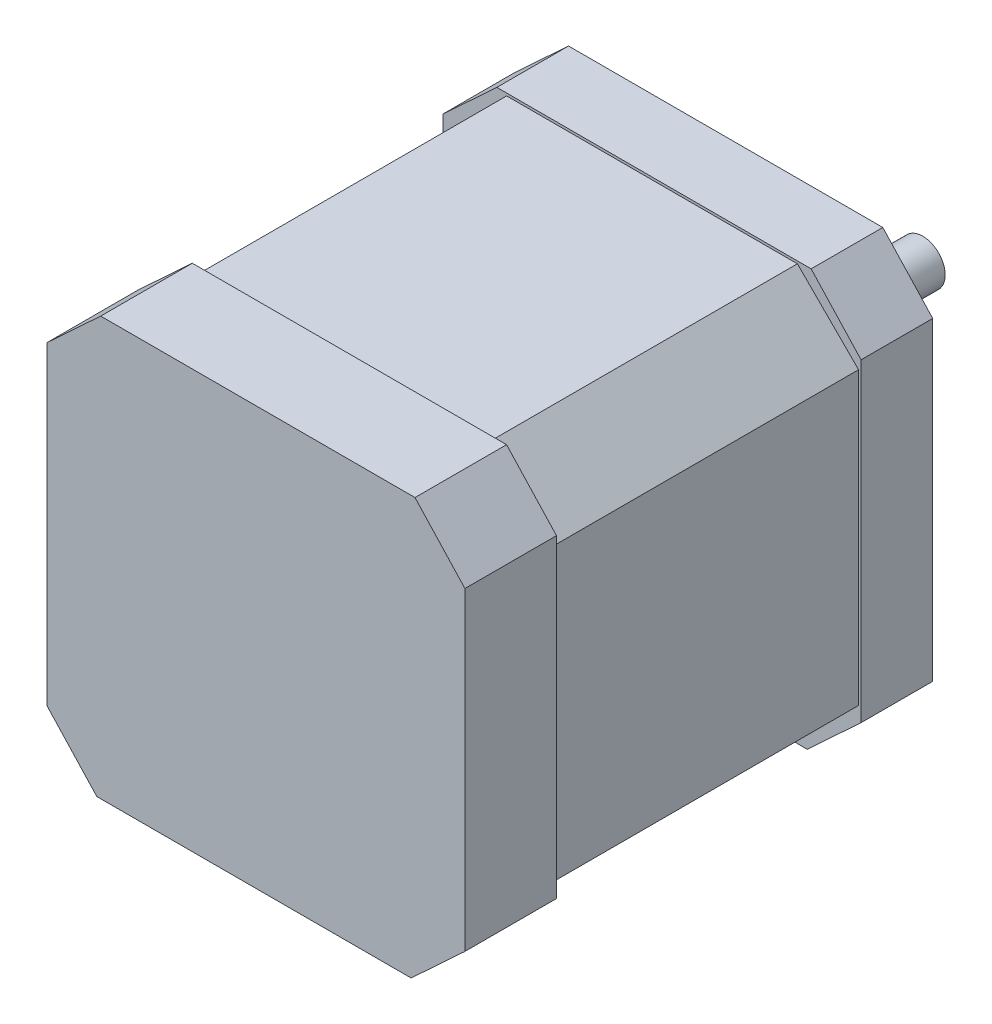
ISO-10303-21;
HEADER;
FILE_DESCRIPTION(('STEP AP214'),'2;1');
FILE_NAME('part.step','',(''),(''),'','','');
FILE_SCHEMA(('AUTOMOTIVE_DESIGN { 1 0 10303 214 1 1 1 1 }'));
ENDSEC;
DATA;
#1=APPLICATION_CONTEXT('core data for automotive mechanical design processes');
#2=APPLICATION_PROTOCOL_DEFINITION('international standard','automotive_design',2000,#1);
#3=PRODUCT_CONTEXT('',#1,'mechanical');
#4=PRODUCT('Part','Part','',(#3));
#5=PRODUCT_RELATED_PRODUCT_CATEGORY('part','',(#4));
#6=PRODUCT_DEFINITION_FORMATION('','',#4);
#7=PRODUCT_DEFINITION_CONTEXT('part definition',#1,'design');
#8=PRODUCT_DEFINITION('design','',#6,#7);
#9=PRODUCT_DEFINITION_SHAPE('','',#8);
#10=(LENGTH_UNIT() NAMED_UNIT(*) SI_UNIT(.MILLI.,.METRE.));
#11=(NAMED_UNIT(*) PLANE_ANGLE_UNIT() SI_UNIT($,.RADIAN.));
#12=(NAMED_UNIT(*) SI_UNIT($,.STERADIAN.) SOLID_ANGLE_UNIT());
#13=UNCERTAINTY_MEASURE_WITH_UNIT(LENGTH_MEASURE(1.E-05),#10,'distance_accuracy_value','');
#14=(GEOMETRIC_REPRESENTATION_CONTEXT(3) GLOBAL_UNCERTAINTY_ASSIGNED_CONTEXT((#13)) GLOBAL_UNIT_ASSIGNED_CONTEXT((#10,
#11,#12)) REPRESENTATION_CONTEXT('',''));
#15=CARTESIAN_POINT('',(0.,0.,0.));
#16=DIRECTION('',(0.,0.,1.));
#17=DIRECTION('',(1.,0.,0.));
#18=AXIS2_PLACEMENT_3D('',#15,#16,#17);
#19=CARTESIAN_POINT('',(21.,0.,47.));
#20=DIRECTION('',(1.,0.,0.));
#21=DIRECTION('',(0.,1.,0.));
#22=AXIS2_PLACEMENT_3D('',#19,#20,#21);
#23=PLANE('',#22);
#24=DIRECTION('',(0.,0.,-1.));
#25=VECTOR('',#24,1.);
#26=CARTESIAN_POINT('',(21.,-15.9841759962391,47.));
#27=LINE('',#26,#25);
#28=CARTESIAN_POINT('',(21.,-15.9841759962391,47.));
#29=VERTEX_POINT('',#28);
#30=CARTESIAN_POINT('',(21.,-15.9841759962391,37.8));
#31=VERTEX_POINT('',#30);
#32=EDGE_CURVE('E379',#29,#31,#27,.T.);
#33=ORIENTED_EDGE('',*,*,#32,.T.);
#34=DIRECTION('',(0.,1.,0.));
#35=VECTOR('',#34,1.);
#36=CARTESIAN_POINT('',(21.,0.,37.8));
#37=LINE('',#36,#35);
#38=CARTESIAN_POINT('',(21.,15.5921718725903,37.8));
#39=VERTEX_POINT('',#38);
#40=EDGE_CURVE('E106',#31,#39,#37,.T.);
#41=ORIENTED_EDGE('',*,*,#40,.T.);
#42=DIRECTION('',(0.,0.,-1.));
#43=VECTOR('',#42,1.);
#44=CARTESIAN_POINT('',(21.,15.5921718725903,47.));
#45=LINE('',#44,#43);
#46=CARTESIAN_POINT('',(21.,15.5921718725903,47.));
#47=VERTEX_POINT('',#46);
#48=EDGE_CURVE('E407',#47,#39,#45,.T.);
#49=ORIENTED_EDGE('',*,*,#48,.F.);
#50=DIRECTION('',(0.,-1.,0.));
#51=VECTOR('',#50,1.);
#52=CARTESIAN_POINT('',(21.,0.,47.));
#53=LINE('',#52,#51);
#54=EDGE_CURVE('E335',#47,#29,#53,.T.);
#55=ORIENTED_EDGE('',*,*,#54,.T.);
#56=EDGE_LOOP('',(#33,#41,#49,#55));
#57=FACE_BOUND('',#56,.T.);
#58=ADVANCED_FACE('F84',(#57),#23,.T.);
#59=CARTESIAN_POINT('',(19.0627004123154,17.6808781736177,47.));
#60=DIRECTION('',(-0.733180785089054,-0.680033775908373,0.));
#61=DIRECTION('',(0.680033775908373,-0.733180785089054,0.));
#62=AXIS2_PLACEMENT_3D('',#59,#60,#61);
#63=PLANE('',#62);
#64=DIRECTION('',(0.680033775908373,-0.733180785089054,0.));
#65=VECTOR('',#64,1.);
#66=CARTESIAN_POINT('',(19.0627004123154,17.6808781736177,37.8));
#67=LINE('',#66,#65);
#68=CARTESIAN_POINT('',(15.9841759962391,21.,37.8));
#69=VERTEX_POINT('',#68);
#70=EDGE_CURVE('E331',#69,#39,#67,.T.);
#71=ORIENTED_EDGE('',*,*,#70,.F.);
#72=DIRECTION('',(0.,0.,-1.));
#73=VECTOR('',#72,1.);
#74=CARTESIAN_POINT('',(15.9841759962391,21.,47.));
#75=LINE('',#74,#73);
#76=CARTESIAN_POINT('',(15.9841759962391,21.,47.));
#77=VERTEX_POINT('',#76);
#78=EDGE_CURVE('E403',#77,#69,#75,.T.);
#79=ORIENTED_EDGE('',*,*,#78,.F.);
#80=DIRECTION('',(-0.680033775908373,0.733180785089054,0.));
#81=VECTOR('',#80,1.);
#82=CARTESIAN_POINT('',(19.0627004123154,17.6808781736177,47.));
#83=LINE('',#82,#81);
#84=EDGE_CURVE('E338',#47,#77,#83,.T.);
#85=ORIENTED_EDGE('',*,*,#84,.F.);
#86=ORIENTED_EDGE('',*,*,#48,.T.);
#87=EDGE_LOOP('',(#71,#79,#85,#86));
#88=FACE_BOUND('',#87,.T.);
#89=ADVANCED_FACE('F479',(#88),#63,.F.);
#90=CARTESIAN_POINT('',(0.,21.,47.));
#91=DIRECTION('',(0.,1.,0.));
#92=DIRECTION('',(0.,0.,1.));
#93=AXIS2_PLACEMENT_3D('',#90,#91,#92);
#94=PLANE('',#93);
#95=ORIENTED_EDGE('',*,*,#78,.T.);
#96=DIRECTION('',(-1.,0.,0.));
#97=VECTOR('',#96,1.);
#98=CARTESIAN_POINT('',(0.,21.,37.8));
#99=LINE('',#98,#97);
#100=CARTESIAN_POINT('',(-15.5921718725903,21.,37.8));
#101=VERTEX_POINT('',#100);
#102=EDGE_CURVE('E328',#69,#101,#99,.T.);
#103=ORIENTED_EDGE('',*,*,#102,.T.);
#104=DIRECTION('',(0.,0.,-1.));
#105=VECTOR('',#104,1.);
#106=CARTESIAN_POINT('',(-15.5921718725903,21.,47.));
#107=LINE('',#106,#105);
#108=CARTESIAN_POINT('',(-15.5921718725903,21.,47.));
#109=VERTEX_POINT('',#108);
#110=EDGE_CURVE('E399',#109,#101,#107,.T.);
#111=ORIENTED_EDGE('',*,*,#110,.F.);
#112=DIRECTION('',(1.,0.,0.));
#113=VECTOR('',#112,1.);
#114=CARTESIAN_POINT('',(0.,21.,47.));
#115=LINE('',#114,#113);
#116=EDGE_CURVE('E341',#109,#77,#115,.T.);
#117=ORIENTED_EDGE('',*,*,#116,.T.);
#118=EDGE_LOOP('',(#95,#103,#111,#117));
#119=FACE_BOUND('',#118,.T.);
#120=ADVANCED_FACE('F485',(#119),#94,.T.);
#121=CARTESIAN_POINT('',(-17.6808781736177,19.0627004123154,47.));
#122=DIRECTION('',(-0.680033775908373,0.733180785089054,0.));
#123=DIRECTION('',(-0.733180785089054,-0.680033775908373,0.));
#124=AXIS2_PLACEMENT_3D('',#121,#122,#123);
#125=PLANE('',#124);
#126=ORIENTED_EDGE('',*,*,#110,.T.);
#127=DIRECTION('',(-0.733180785089054,-0.680033775908373,0.));
#128=VECTOR('',#127,1.);
#129=CARTESIAN_POINT('',(-17.6808781736177,19.0627004123154,37.8));
#130=LINE('',#129,#128);
#131=CARTESIAN_POINT('',(-21.,15.9841759962391,37.8));
#132=VERTEX_POINT('',#131);
#133=EDGE_CURVE('E325',#101,#132,#130,.T.);
#134=ORIENTED_EDGE('',*,*,#133,.T.);
#135=DIRECTION('',(0.,0.,-1.));
#136=VECTOR('',#135,1.);
#137=CARTESIAN_POINT('',(-21.,15.9841759962391,47.));
#138=LINE('',#137,#136);
#139=CARTESIAN_POINT('',(-21.,15.9841759962391,47.));
#140=VERTEX_POINT('',#139);
#141=EDGE_CURVE('E395',#140,#132,#138,.T.);
#142=ORIENTED_EDGE('',*,*,#141,.F.);
#143=DIRECTION('',(0.733180785089054,0.680033775908373,0.));
#144=VECTOR('',#143,1.);
#145=CARTESIAN_POINT('',(-17.6808781736177,19.0627004123154,47.));
#146=LINE('',#145,#144);
#147=EDGE_CURVE('E344',#140,#109,#146,.T.);
#148=ORIENTED_EDGE('',*,*,#147,.T.);
#149=EDGE_LOOP('',(#126,#134,#142,#148));
#150=FACE_BOUND('',#149,.T.);
#151=ADVANCED_FACE('F571',(#150),#125,.T.);
#152=CARTESIAN_POINT('',(-21.,0.,47.));
#153=DIRECTION('',(1.,0.,0.));
#154=DIRECTION('',(0.,1.,0.));
#155=AXIS2_PLACEMENT_3D('',#152,#153,#154);
#156=PLANE('',#155);
#157=DIRECTION('',(0.,1.,0.));
#158=VECTOR('',#157,1.);
#159=CARTESIAN_POINT('',(-21.,0.,37.8));
#160=LINE('',#159,#158);
#161=CARTESIAN_POINT('',(-21.,-15.5921718725903,37.8));
#162=VERTEX_POINT('',#161);
#163=EDGE_CURVE('E323',#162,#132,#160,.T.);
#164=ORIENTED_EDGE('',*,*,#163,.F.);
#165=DIRECTION('',(0.,0.,-1.));
#166=VECTOR('',#165,1.);
#167=CARTESIAN_POINT('',(-21.,-15.5921718725903,47.));
#168=LINE('',#167,#166);
#169=CARTESIAN_POINT('',(-21.,-15.5921718725903,47.));
#170=VERTEX_POINT('',#169);
#171=EDGE_CURVE('E391',#170,#162,#168,.T.);
#172=ORIENTED_EDGE('',*,*,#171,.F.);
#173=DIRECTION('',(0.,-1.,0.));
#174=VECTOR('',#173,1.);
#175=CARTESIAN_POINT('',(-21.,0.,47.));
#176=LINE('',#175,#174);
#177=EDGE_CURVE('E347',#140,#170,#176,.T.);
#178=ORIENTED_EDGE('',*,*,#177,.F.);
#179=ORIENTED_EDGE('',*,*,#141,.T.);
#180=EDGE_LOOP('',(#164,#172,#178,#179));
#181=FACE_BOUND('',#180,.T.);
#182=ADVANCED_FACE('F568',(#181),#156,.F.);
#183=CARTESIAN_POINT('',(-19.0627004123154,-17.6808781736177,47.));
#184=DIRECTION('',(-0.733180785089054,-0.680033775908373,0.));
#185=DIRECTION('',(0.680033775908373,-0.733180785089054,0.));
#186=AXIS2_PLACEMENT_3D('',#183,#184,#185);
#187=PLANE('',#186);
#188=ORIENTED_EDGE('',*,*,#171,.T.);
#189=DIRECTION('',(0.680033775908373,-0.733180785089054,0.));
#190=VECTOR('',#189,1.);
#191=CARTESIAN_POINT('',(-19.0627004123154,-17.6808781736177,37.8));
#192=LINE('',#191,#190);
#193=CARTESIAN_POINT('',(-15.9841759962391,-21.,37.8));
#194=VERTEX_POINT('',#193);
#195=EDGE_CURVE('E320',#162,#194,#192,.T.);
#196=ORIENTED_EDGE('',*,*,#195,.T.);
#197=DIRECTION('',(0.,0.,-1.));
#198=VECTOR('',#197,1.);
#199=CARTESIAN_POINT('',(-15.9841759962391,-21.,47.));
#200=LINE('',#199,#198);
#201=CARTESIAN_POINT('',(-15.9841759962391,-21.,47.));
#202=VERTEX_POINT('',#201);
#203=EDGE_CURVE('E387',#202,#194,#200,.T.);
#204=ORIENTED_EDGE('',*,*,#203,.F.);
#205=DIRECTION('',(-0.680033775908373,0.733180785089054,0.));
#206=VECTOR('',#205,1.);
#207=CARTESIAN_POINT('',(-19.0627004123154,-17.6808781736177,47.));
#208=LINE('',#207,#206);
#209=EDGE_CURVE('E349',#202,#170,#208,.T.);
#210=ORIENTED_EDGE('',*,*,#209,.T.);
#211=EDGE_LOOP('',(#188,#196,#204,#210));
#212=FACE_BOUND('',#211,.T.);
#213=ADVANCED_FACE('F551',(#212),#187,.T.);
#214=CARTESIAN_POINT('',(0.,-21.,47.));
#215=DIRECTION('',(0.,1.,0.));
#216=DIRECTION('',(0.,0.,1.));
#217=AXIS2_PLACEMENT_3D('',#214,#215,#216);
#218=PLANE('',#217);
#219=DIRECTION('',(-1.,0.,0.));
#220=VECTOR('',#219,1.);
#221=CARTESIAN_POINT('',(0.,-21.,37.8));
#222=LINE('',#221,#220);
#223=CARTESIAN_POINT('',(15.5921718725902,-21.,37.8));
#224=VERTEX_POINT('',#223);
#225=EDGE_CURVE('E318',#224,#194,#222,.T.);
#226=ORIENTED_EDGE('',*,*,#225,.F.);
#227=DIRECTION('',(0.,0.,-1.));
#228=VECTOR('',#227,1.);
#229=CARTESIAN_POINT('',(15.5921718725902,-21.,47.));
#230=LINE('',#229,#228);
#231=CARTESIAN_POINT('',(15.5921718725902,-21.,47.));
#232=VERTEX_POINT('',#231);
#233=EDGE_CURVE('E383',#232,#224,#230,.T.);
#234=ORIENTED_EDGE('',*,*,#233,.F.);
#235=DIRECTION('',(1.,0.,0.));
#236=VECTOR('',#235,1.);
#237=CARTESIAN_POINT('',(0.,-21.,47.));
#238=LINE('',#237,#236);
#239=EDGE_CURVE('E352',#202,#232,#238,.T.);
#240=ORIENTED_EDGE('',*,*,#239,.F.);
#241=ORIENTED_EDGE('',*,*,#203,.T.);
#242=EDGE_LOOP('',(#226,#234,#240,#241));
#243=FACE_BOUND('',#242,.T.);
#244=ADVANCED_FACE('F539',(#243),#218,.F.);
#245=CARTESIAN_POINT('',(17.6808781736177,-19.0627004123154,47.));
#246=DIRECTION('',(-0.680033775908373,0.733180785089054,0.));
#247=DIRECTION('',(-0.733180785089054,-0.680033775908373,0.));
#248=AXIS2_PLACEMENT_3D('',#245,#246,#247);
#249=PLANE('',#248);
#250=DIRECTION('',(-0.733180785089054,-0.680033775908373,0.));
#251=VECTOR('',#250,1.);
#252=CARTESIAN_POINT('',(17.6808781736177,-19.0627004123154,37.8));
#253=LINE('',#252,#251);
#254=EDGE_CURVE('E91',#31,#224,#253,.T.);
#255=ORIENTED_EDGE('',*,*,#254,.F.);
#256=ORIENTED_EDGE('',*,*,#32,.F.);
#257=DIRECTION('',(0.733180785089054,0.680033775908373,0.));
#258=VECTOR('',#257,1.);
#259=CARTESIAN_POINT('',(17.6808781736177,-19.0627004123154,47.));
#260=LINE('',#259,#258);
#261=EDGE_CURVE('E354',#232,#29,#260,.T.);
#262=ORIENTED_EDGE('',*,*,#261,.F.);
#263=ORIENTED_EDGE('',*,*,#233,.T.);
#264=EDGE_LOOP('',(#255,#256,#262,#263));
#265=FACE_BOUND('',#264,.T.);
#266=ADVANCED_FACE('F533',(#265),#249,.F.);
#267=CARTESIAN_POINT('',(0.,0.,47.));
#268=DIRECTION('',(0.,0.,1.));
#269=DIRECTION('',(1.,0.,0.));
#270=AXIS2_PLACEMENT_3D('',#267,#268,#269);
#271=PLANE('',#270);
#272=ORIENTED_EDGE('',*,*,#54,.F.);
#273=ORIENTED_EDGE('',*,*,#84,.T.);
#274=ORIENTED_EDGE('',*,*,#116,.F.);
#275=ORIENTED_EDGE('',*,*,#147,.F.);
#276=ORIENTED_EDGE('',*,*,#177,.T.);
#277=ORIENTED_EDGE('',*,*,#209,.F.);
#278=ORIENTED_EDGE('',*,*,#239,.T.);
#279=ORIENTED_EDGE('',*,*,#261,.T.);
#280=EDGE_LOOP('',(#272,#273,#274,#275,#276,#277,#278,#279));
#281=FACE_BOUND('',#280,.T.);
#282=ADVANCED_FACE('F543',(#281),#271,.T.);
#283=CARTESIAN_POINT('',(0.,0.,37.8));
#284=DIRECTION('',(0.,0.,-1.));
#285=DIRECTION('',(-1.,0.,0.));
#286=AXIS2_PLACEMENT_3D('',#283,#284,#285);
#287=PLANE('',#286);
#288=ORIENTED_EDGE('',*,*,#254,.T.);
#289=ORIENTED_EDGE('',*,*,#225,.T.);
#290=ORIENTED_EDGE('',*,*,#195,.F.);
#291=ORIENTED_EDGE('',*,*,#163,.T.);
#292=ORIENTED_EDGE('',*,*,#133,.F.);
#293=ORIENTED_EDGE('',*,*,#102,.F.);
#294=ORIENTED_EDGE('',*,*,#70,.T.);
#295=ORIENTED_EDGE('',*,*,#40,.F.);
#296=EDGE_LOOP('',(#288,#289,#290,#291,#292,#293,#294,#295));
#297=FACE_BOUND('',#296,.T.);
#298=DIRECTION('',(-0.707106781186548,0.707106781186547,0.));
#299=VECTOR('',#298,1.);
#300=CARTESIAN_POINT('',(17.6776695296637,17.6776695296637,37.8));
#301=LINE('',#300,#299);
#302=CARTESIAN_POINT('',(20.75,14.6053390593274,37.8));
#303=VERTEX_POINT('',#302);
#304=CARTESIAN_POINT('',(14.6053390593274,20.75,37.8));
#305=VERTEX_POINT('',#304);
#306=EDGE_CURVE('E248',#303,#305,#301,.T.);
#307=ORIENTED_EDGE('',*,*,#306,.T.);
#308=DIRECTION('',(1.,0.,0.));
#309=VECTOR('',#308,1.);
#310=CARTESIAN_POINT('',(0.,20.75,37.8));
#311=LINE('',#310,#309);
#312=CARTESIAN_POINT('',(-14.6053390593274,20.75,37.8));
#313=VERTEX_POINT('',#312);
#314=EDGE_CURVE('E262',#313,#305,#311,.T.);
#315=ORIENTED_EDGE('',*,*,#314,.F.);
#316=DIRECTION('',(0.707106781186547,0.707106781186548,0.));
#317=VECTOR('',#316,1.);
#318=CARTESIAN_POINT('',(-17.6776695296637,17.6776695296637,37.8));
#319=LINE('',#318,#317);
#320=CARTESIAN_POINT('',(-20.75,14.6053390593274,37.8));
#321=VERTEX_POINT('',#320);
#322=EDGE_CURVE('E270',#321,#313,#319,.T.);
#323=ORIENTED_EDGE('',*,*,#322,.F.);
#324=DIRECTION('',(0.,1.,0.));
#325=VECTOR('',#324,1.);
#326=CARTESIAN_POINT('',(-20.75,0.,37.8));
#327=LINE('',#326,#325);
#328=CARTESIAN_POINT('',(-20.75,-14.6053390593274,37.8));
#329=VERTEX_POINT('',#328);
#330=EDGE_CURVE('E272',#329,#321,#327,.T.);
#331=ORIENTED_EDGE('',*,*,#330,.F.);
#332=DIRECTION('',(-0.707106781186547,0.707106781186548,0.));
#333=VECTOR('',#332,1.);
#334=CARTESIAN_POINT('',(-17.6776695296637,-17.6776695296637,37.8));
#335=LINE('',#334,#333);
#336=CARTESIAN_POINT('',(-14.6053390593274,-20.75,37.8));
#337=VERTEX_POINT('',#336);
#338=EDGE_CURVE('E278',#337,#329,#335,.T.);
#339=ORIENTED_EDGE('',*,*,#338,.F.);
#340=DIRECTION('',(1.,0.,0.));
#341=VECTOR('',#340,1.);
#342=CARTESIAN_POINT('',(0.,-20.75,37.8));
#343=LINE('',#342,#341);
#344=CARTESIAN_POINT('',(14.6053390593274,-20.75,37.8));
#345=VERTEX_POINT('',#344);
#346=EDGE_CURVE('E281',#337,#345,#343,.T.);
#347=ORIENTED_EDGE('',*,*,#346,.T.);
#348=DIRECTION('',(0.707106781186547,0.707106781186548,0.));
#349=VECTOR('',#348,1.);
#350=CARTESIAN_POINT('',(17.6776695296637,-17.6776695296637,37.8));
#351=LINE('',#350,#349);
#352=CARTESIAN_POINT('',(20.75,-14.6053390593274,37.8));
#353=VERTEX_POINT('',#352);
#354=EDGE_CURVE('E284',#345,#353,#351,.T.);
#355=ORIENTED_EDGE('',*,*,#354,.T.);
#356=DIRECTION('',(0.,1.,0.));
#357=VECTOR('',#356,1.);
#358=CARTESIAN_POINT('',(20.75,0.,37.8));
#359=LINE('',#358,#357);
#360=EDGE_CURVE('E266',#353,#303,#359,.T.);
#361=ORIENTED_EDGE('',*,*,#360,.T.);
#362=EDGE_LOOP('',(#307,#315,#323,#331,#339,#347,#355,#361));
#363=FACE_BOUND('',#362,.T.);
#364=ADVANCED_FACE('F260',(#297,#363),#287,.T.);
#365=CARTESIAN_POINT('',(17.6776695296637,17.6776695296637,-86.9741340859454));
#366=DIRECTION('',(0.707106781186547,0.707106781186548,0.));
#367=DIRECTION('',(-0.707106781186548,0.707106781186547,0.));
#368=AXIS2_PLACEMENT_3D('',#365,#366,#367);
#369=PLANE('',#368);
#370=DIRECTION('',(0.,0.,1.));
#371=VECTOR('',#370,1.);
#372=CARTESIAN_POINT('',(14.6053390593274,20.75,-86.9741340859454));
#373=LINE('',#372,#371);
#374=CARTESIAN_POINT('',(14.6053390593274,20.75,7.2));
#375=VERTEX_POINT('',#374);
#376=EDGE_CURVE('E244',#375,#305,#373,.T.);
#377=ORIENTED_EDGE('',*,*,#376,.T.);
#378=ORIENTED_EDGE('',*,*,#306,.F.);
#379=DIRECTION('',(0.,0.,1.));
#380=VECTOR('',#379,1.);
#381=CARTESIAN_POINT('',(20.75,14.6053390593274,-86.9741340859454));
#382=LINE('',#381,#380);
#383=CARTESIAN_POINT('',(20.75,14.6053390593274,7.2));
#384=VERTEX_POINT('',#383);
#385=EDGE_CURVE('E255',#384,#303,#382,.T.);
#386=ORIENTED_EDGE('',*,*,#385,.F.);
#387=DIRECTION('',(0.707106781186548,-0.707106781186547,0.));
#388=VECTOR('',#387,1.);
#389=CARTESIAN_POINT('',(17.6776695296637,17.6776695296637,7.2));
#390=LINE('',#389,#388);
#391=EDGE_CURVE('E250',#375,#384,#390,.T.);
#392=ORIENTED_EDGE('',*,*,#391,.F.);
#393=EDGE_LOOP('',(#377,#378,#386,#392));
#394=FACE_BOUND('',#393,.T.);
#395=ADVANCED_FACE('F246',(#394),#369,.T.);
#396=CARTESIAN_POINT('',(0.,20.75,-86.9741340859454));
#397=DIRECTION('',(0.,-1.,0.));
#398=DIRECTION('',(0.,0.,-1.));
#399=AXIS2_PLACEMENT_3D('',#396,#397,#398);
#400=PLANE('',#399);
#401=DIRECTION('',(-1.,0.,0.));
#402=VECTOR('',#401,1.);
#403=CARTESIAN_POINT('',(0.,20.75,7.2));
#404=LINE('',#403,#402);
#405=CARTESIAN_POINT('',(-14.6053390593274,20.75,7.2));
#406=VERTEX_POINT('',#405);
#407=EDGE_CURVE('E302',#375,#406,#404,.T.);
#408=ORIENTED_EDGE('',*,*,#407,.T.);
#409=DIRECTION('',(0.,0.,1.));
#410=VECTOR('',#409,1.);
#411=CARTESIAN_POINT('',(-14.6053390593274,20.75,-86.9741340859454));
#412=LINE('',#411,#410);
#413=EDGE_CURVE('E254',#406,#313,#412,.T.);
#414=ORIENTED_EDGE('',*,*,#413,.T.);
#415=ORIENTED_EDGE('',*,*,#314,.T.);
#416=ORIENTED_EDGE('',*,*,#376,.F.);
#417=EDGE_LOOP('',(#408,#414,#415,#416));
#418=FACE_BOUND('',#417,.T.);
#419=ADVANCED_FACE('F268',(#418),#400,.F.);
#420=CARTESIAN_POINT('',(-17.6776695296637,17.6776695296637,-86.9741340859454));
#421=DIRECTION('',(0.707106781186548,-0.707106781186547,0.));
#422=DIRECTION('',(0.707106781186547,0.707106781186548,0.));
#423=AXIS2_PLACEMENT_3D('',#420,#421,#422);
#424=PLANE('',#423);
#425=DIRECTION('',(-0.707106781186547,-0.707106781186548,0.));
#426=VECTOR('',#425,1.);
#427=CARTESIAN_POINT('',(-17.6776695296637,17.6776695296637,7.2));
#428=LINE('',#427,#426);
#429=CARTESIAN_POINT('',(-20.75,14.6053390593274,7.2));
#430=VERTEX_POINT('',#429);
#431=EDGE_CURVE('E431',#406,#430,#428,.T.);
#432=ORIENTED_EDGE('',*,*,#431,.T.);
#433=DIRECTION('',(0.,0.,1.));
#434=VECTOR('',#433,1.);
#435=CARTESIAN_POINT('',(-20.75,14.6053390593274,-86.9741340859454));
#436=LINE('',#435,#434);
#437=EDGE_CURVE('E294',#430,#321,#436,.T.);
#438=ORIENTED_EDGE('',*,*,#437,.T.);
#439=ORIENTED_EDGE('',*,*,#322,.T.);
#440=ORIENTED_EDGE('',*,*,#413,.F.);
#441=EDGE_LOOP('',(#432,#438,#439,#440));
#442=FACE_BOUND('',#441,.T.);
#443=ADVANCED_FACE('F469',(#442),#424,.F.);
#444=CARTESIAN_POINT('',(-20.75,0.,-86.9741340859454));
#445=DIRECTION('',(1.,0.,0.));
#446=DIRECTION('',(0.,0.,-1.));
#447=AXIS2_PLACEMENT_3D('',#444,#445,#446);
#448=PLANE('',#447);
#449=DIRECTION('',(0.,-1.,0.));
#450=VECTOR('',#449,1.);
#451=CARTESIAN_POINT('',(-20.75,0.,7.2));
#452=LINE('',#451,#450);
#453=CARTESIAN_POINT('',(-20.75,-14.6053390593274,7.2));
#454=VERTEX_POINT('',#453);
#455=EDGE_CURVE('E433',#430,#454,#452,.T.);
#456=ORIENTED_EDGE('',*,*,#455,.T.);
#457=DIRECTION('',(0.,0.,1.));
#458=VECTOR('',#457,1.);
#459=CARTESIAN_POINT('',(-20.75,-14.6053390593274,-86.9741340859454));
#460=LINE('',#459,#458);
#461=EDGE_CURVE('E292',#454,#329,#460,.T.);
#462=ORIENTED_EDGE('',*,*,#461,.T.);
#463=ORIENTED_EDGE('',*,*,#330,.T.);
#464=ORIENTED_EDGE('',*,*,#437,.F.);
#465=EDGE_LOOP('',(#456,#462,#463,#464));
#466=FACE_BOUND('',#465,.T.);
#467=ADVANCED_FACE('F466',(#466),#448,.F.);
#468=CARTESIAN_POINT('',(-17.6776695296637,-17.6776695296637,-86.9741340859454));
#469=DIRECTION('',(0.707106781186548,0.707106781186547,0.));
#470=DIRECTION('',(-0.707106781186547,0.707106781186548,0.));
#471=AXIS2_PLACEMENT_3D('',#468,#469,#470);
#472=PLANE('',#471);
#473=DIRECTION('',(0.707106781186547,-0.707106781186548,0.));
#474=VECTOR('',#473,1.);
#475=CARTESIAN_POINT('',(-17.6776695296637,-17.6776695296637,7.2));
#476=LINE('',#475,#474);
#477=CARTESIAN_POINT('',(-14.6053390593274,-20.75,7.2));
#478=VERTEX_POINT('',#477);
#479=EDGE_CURVE('E435',#454,#478,#476,.T.);
#480=ORIENTED_EDGE('',*,*,#479,.T.);
#481=DIRECTION('',(0.,0.,1.));
#482=VECTOR('',#481,1.);
#483=CARTESIAN_POINT('',(-14.6053390593274,-20.75,-86.9741340859454));
#484=LINE('',#483,#482);
#485=EDGE_CURVE('E290',#478,#337,#484,.T.);
#486=ORIENTED_EDGE('',*,*,#485,.T.);
#487=ORIENTED_EDGE('',*,*,#338,.T.);
#488=ORIENTED_EDGE('',*,*,#461,.F.);
#489=EDGE_LOOP('',(#480,#486,#487,#488));
#490=FACE_BOUND('',#489,.T.);
#491=ADVANCED_FACE('F464',(#490),#472,.F.);
#492=CARTESIAN_POINT('',(0.,-20.75,-86.9741340859454));
#493=DIRECTION('',(0.,-1.,0.));
#494=DIRECTION('',(0.,0.,-1.));
#495=AXIS2_PLACEMENT_3D('',#492,#493,#494);
#496=PLANE('',#495);
#497=DIRECTION('',(0.,0.,1.));
#498=VECTOR('',#497,1.);
#499=CARTESIAN_POINT('',(14.6053390593274,-20.75,-86.9741340859454));
#500=LINE('',#499,#498);
#501=CARTESIAN_POINT('',(14.6053390593274,-20.75,7.2));
#502=VERTEX_POINT('',#501);
#503=EDGE_CURVE('E288',#502,#345,#500,.T.);
#504=ORIENTED_EDGE('',*,*,#503,.T.);
#505=ORIENTED_EDGE('',*,*,#346,.F.);
#506=ORIENTED_EDGE('',*,*,#485,.F.);
#507=DIRECTION('',(-1.,0.,0.));
#508=VECTOR('',#507,1.);
#509=CARTESIAN_POINT('',(0.,-20.75,7.2));
#510=LINE('',#509,#508);
#511=EDGE_CURVE('E437',#502,#478,#510,.T.);
#512=ORIENTED_EDGE('',*,*,#511,.F.);
#513=EDGE_LOOP('',(#504,#505,#506,#512));
#514=FACE_BOUND('',#513,.T.);
#515=ADVANCED_FACE('F458',(#514),#496,.T.);
#516=CARTESIAN_POINT('',(17.6776695296637,-17.6776695296637,-86.9741340859454));
#517=DIRECTION('',(0.707106781186548,-0.707106781186547,0.));
#518=DIRECTION('',(0.707106781186547,0.707106781186548,0.));
#519=AXIS2_PLACEMENT_3D('',#516,#517,#518);
#520=PLANE('',#519);
#521=DIRECTION('',(0.,0.,1.));
#522=VECTOR('',#521,1.);
#523=CARTESIAN_POINT('',(20.75,-14.6053390593274,-86.9741340859454));
#524=LINE('',#523,#522);
#525=CARTESIAN_POINT('',(20.75,-14.6053390593274,7.2));
#526=VERTEX_POINT('',#525);
#527=EDGE_CURVE('E286',#526,#353,#524,.T.);
#528=ORIENTED_EDGE('',*,*,#527,.T.);
#529=ORIENTED_EDGE('',*,*,#354,.F.);
#530=ORIENTED_EDGE('',*,*,#503,.F.);
#531=DIRECTION('',(-0.707106781186547,-0.707106781186548,0.));
#532=VECTOR('',#531,1.);
#533=CARTESIAN_POINT('',(17.6776695296637,-17.6776695296637,7.2));
#534=LINE('',#533,#532);
#535=EDGE_CURVE('E440',#526,#502,#534,.T.);
#536=ORIENTED_EDGE('',*,*,#535,.F.);
#537=EDGE_LOOP('',(#528,#529,#530,#536));
#538=FACE_BOUND('',#537,.T.);
#539=ADVANCED_FACE('F451',(#538),#520,.T.);
#540=CARTESIAN_POINT('',(20.75,0.,-86.9741340859454));
#541=DIRECTION('',(1.,0.,0.));
#542=DIRECTION('',(0.,0.,-1.));
#543=AXIS2_PLACEMENT_3D('',#540,#541,#542);
#544=PLANE('',#543);
#545=ORIENTED_EDGE('',*,*,#385,.T.);
#546=ORIENTED_EDGE('',*,*,#360,.F.);
#547=ORIENTED_EDGE('',*,*,#527,.F.);
#548=DIRECTION('',(0.,-1.,0.));
#549=VECTOR('',#548,1.);
#550=CARTESIAN_POINT('',(20.75,0.,7.2));
#551=LINE('',#550,#549);
#552=EDGE_CURVE('E299',#384,#526,#551,.T.);
#553=ORIENTED_EDGE('',*,*,#552,.F.);
#554=EDGE_LOOP('',(#545,#546,#547,#553));
#555=FACE_BOUND('',#554,.T.);
#556=ADVANCED_FACE('F448',(#555),#544,.T.);
#557=CARTESIAN_POINT('',(0.,0.,7.2));
#558=DIRECTION('',(0.,0.,1.));
#559=DIRECTION('',(1.,0.,0.));
#560=AXIS2_PLACEMENT_3D('',#557,#558,#559);
#561=PLANE('',#560);
#562=DIRECTION('',(-0.680033775908373,0.733180785089054,0.));
#563=VECTOR('',#562,1.);
#564=CARTESIAN_POINT('',(19.0627004123154,17.6808781736177,7.2));
#565=LINE('',#564,#563);
#566=CARTESIAN_POINT('',(21.,15.5921718725903,7.2));
#567=VERTEX_POINT('',#566);
#568=CARTESIAN_POINT('',(15.9841759962391,21.,7.2));
#569=VERTEX_POINT('',#568);
#570=EDGE_CURVE('E313',#567,#569,#565,.T.);
#571=ORIENTED_EDGE('',*,*,#570,.T.);
#572=DIRECTION('',(1.,0.,0.));
#573=VECTOR('',#572,1.);
#574=CARTESIAN_POINT('',(0.,21.,7.2));
#575=LINE('',#574,#573);
#576=CARTESIAN_POINT('',(-15.5921718725903,21.,7.2));
#577=VERTEX_POINT('',#576);
#578=EDGE_CURVE('E310',#577,#569,#575,.T.);
#579=ORIENTED_EDGE('',*,*,#578,.F.);
#580=DIRECTION('',(0.733180785089054,0.680033775908373,0.));
#581=VECTOR('',#580,1.);
#582=CARTESIAN_POINT('',(-17.6808781736177,19.0627004123154,7.2));
#583=LINE('',#582,#581);
#584=CARTESIAN_POINT('',(-21.,15.9841759962391,7.2));
#585=VERTEX_POINT('',#584);
#586=EDGE_CURVE('E307',#585,#577,#583,.T.);
#587=ORIENTED_EDGE('',*,*,#586,.F.);
#588=DIRECTION('',(0.,-1.,0.));
#589=VECTOR('',#588,1.);
#590=CARTESIAN_POINT('',(-21.,0.,7.2));
#591=LINE('',#590,#589);
#592=CARTESIAN_POINT('',(-21.,-15.5921718725903,7.2));
#593=VERTEX_POINT('',#592);
#594=EDGE_CURVE('E305',#585,#593,#591,.T.);
#595=ORIENTED_EDGE('',*,*,#594,.T.);
#596=DIRECTION('',(-0.680033775908373,0.733180785089054,0.));
#597=VECTOR('',#596,1.);
#598=CARTESIAN_POINT('',(-19.0627004123154,-17.6808781736177,7.2));
#599=LINE('',#598,#597);
#600=CARTESIAN_POINT('',(-15.9841759962391,-21.,7.2));
#601=VERTEX_POINT('',#600);
#602=EDGE_CURVE('E301',#601,#593,#599,.T.);
#603=ORIENTED_EDGE('',*,*,#602,.F.);
#604=DIRECTION('',(1.,0.,0.));
#605=VECTOR('',#604,1.);
#606=CARTESIAN_POINT('',(0.,-21.,7.2));
#607=LINE('',#606,#605);
#608=CARTESIAN_POINT('',(15.5921718725902,-21.,7.2));
#609=VERTEX_POINT('',#608);
#610=EDGE_CURVE('E98',#601,#609,#607,.T.);
#611=ORIENTED_EDGE('',*,*,#610,.T.);
#612=DIRECTION('',(0.733180785089054,0.680033775908373,0.));
#613=VECTOR('',#612,1.);
#614=CARTESIAN_POINT('',(17.6808781736177,-19.0627004123154,7.2));
#615=LINE('',#614,#613);
#616=CARTESIAN_POINT('',(21.,-15.9841759962391,7.2));
#617=VERTEX_POINT('',#616);
#618=EDGE_CURVE('E410',#609,#617,#615,.T.);
#619=ORIENTED_EDGE('',*,*,#618,.T.);
#620=DIRECTION('',(0.,-1.,0.));
#621=VECTOR('',#620,1.);
#622=CARTESIAN_POINT('',(21.,0.,7.2));
#623=LINE('',#622,#621);
#624=EDGE_CURVE('E315',#567,#617,#623,.T.);
#625=ORIENTED_EDGE('',*,*,#624,.F.);
#626=EDGE_LOOP('',(#571,#579,#587,#595,#603,#611,#619,#625));
#627=FACE_BOUND('',#626,.T.);
#628=ORIENTED_EDGE('',*,*,#391,.T.);
#629=ORIENTED_EDGE('',*,*,#552,.T.);
#630=ORIENTED_EDGE('',*,*,#535,.T.);
#631=ORIENTED_EDGE('',*,*,#511,.T.);
#632=ORIENTED_EDGE('',*,*,#479,.F.);
#633=ORIENTED_EDGE('',*,*,#455,.F.);
#634=ORIENTED_EDGE('',*,*,#431,.F.);
#635=ORIENTED_EDGE('',*,*,#407,.F.);
#636=EDGE_LOOP('',(#628,#629,#630,#631,#632,#633,#634,#635));
#637=FACE_BOUND('',#636,.T.);
#638=ADVANCED_FACE('F445',(#627,#637),#561,.T.);
#639=CARTESIAN_POINT('',(0.,0.,0.));
#640=DIRECTION('',(0.,0.,1.));
#641=DIRECTION('',(1.,0.,0.));
#642=AXIS2_PLACEMENT_3D('',#639,#640,#641);
#643=PLANE('',#642);
#644=CARTESIAN_POINT('',(15.5,-15.5,0.));
#645=DIRECTION('',(0.,0.,-1.));
#646=DIRECTION('',(-1.,0.,0.));
#647=AXIS2_PLACEMENT_3D('',#644,#645,#646);
#648=CIRCLE('',#647,1.5);
#649=CARTESIAN_POINT('',(14.,-15.5,0.));
#650=VERTEX_POINT('',#649);
#651=EDGE_CURVE('E875',#650,#650,#648,.T.);
#652=ORIENTED_EDGE('',*,*,#651,.F.);
#653=EDGE_LOOP('',(#652));
#654=FACE_BOUND('',#653,.T.);
#655=CARTESIAN_POINT('',(15.5,15.5,0.));
#656=DIRECTION('',(0.,0.,-1.));
#657=DIRECTION('',(-1.,0.,0.));
#658=AXIS2_PLACEMENT_3D('',#655,#656,#657);
#659=CIRCLE('',#658,1.5);
#660=CARTESIAN_POINT('',(14.,15.5,0.));
#661=VERTEX_POINT('',#660);
#662=EDGE_CURVE('E884',#661,#661,#659,.T.);
#663=ORIENTED_EDGE('',*,*,#662,.F.);
#664=EDGE_LOOP('',(#663));
#665=FACE_BOUND('',#664,.T.);
#666=CARTESIAN_POINT('',(-15.5,15.5,0.));
#667=DIRECTION('',(0.,0.,-1.));
#668=DIRECTION('',(-1.,0.,0.));
#669=AXIS2_PLACEMENT_3D('',#666,#667,#668);
#670=CIRCLE('',#669,1.5);
#671=CARTESIAN_POINT('',(-17.,15.5,0.));
#672=VERTEX_POINT('',#671);
#673=EDGE_CURVE('E890',#672,#672,#670,.T.);
#674=ORIENTED_EDGE('',*,*,#673,.F.);
#675=EDGE_LOOP('',(#674));
#676=FACE_BOUND('',#675,.T.);
#677=CARTESIAN_POINT('',(-15.5,-15.5,0.));
#678=DIRECTION('',(0.,0.,-1.));
#679=DIRECTION('',(-1.,0.,0.));
#680=AXIS2_PLACEMENT_3D('',#677,#678,#679);
#681=CIRCLE('',#680,1.5);
#682=CARTESIAN_POINT('',(-17.,-15.5,0.));
#683=VERTEX_POINT('',#682);
#684=EDGE_CURVE('E426',#683,#683,#681,.T.);
#685=ORIENTED_EDGE('',*,*,#684,.F.);
#686=EDGE_LOOP('',(#685));
#687=FACE_BOUND('',#686,.T.);
#688=CARTESIAN_POINT('',(0.,0.,0.));
#689=DIRECTION('',(0.,0.,1.));
#690=DIRECTION('',(1.,0.,0.));
#691=AXIS2_PLACEMENT_3D('',#688,#689,#690);
#692=CIRCLE('',#691,10.);
#693=CARTESIAN_POINT('',(10.,0.,0.));
#694=VERTEX_POINT('',#693);
#695=EDGE_CURVE('E13',#694,#694,#692,.F.);
#696=ORIENTED_EDGE('',*,*,#695,.F.);
#697=EDGE_LOOP('',(#696));
#698=FACE_BOUND('',#697,.T.);
#699=DIRECTION('',(0.,-1.,0.));
#700=VECTOR('',#699,1.);
#701=CARTESIAN_POINT('',(21.,0.,0.));
#702=LINE('',#701,#700);
#703=CARTESIAN_POINT('',(21.,15.5921718725903,0.));
#704=VERTEX_POINT('',#703);
#705=CARTESIAN_POINT('',(21.,-15.9841759962391,0.));
#706=VERTEX_POINT('',#705);
#707=EDGE_CURVE('E334',#704,#706,#702,.T.);
#708=ORIENTED_EDGE('',*,*,#707,.T.);
#709=DIRECTION('',(0.733180785089054,0.680033775908373,0.));
#710=VECTOR('',#709,1.);
#711=CARTESIAN_POINT('',(17.6808781736177,-19.0627004123154,0.));
#712=LINE('',#711,#710);
#713=CARTESIAN_POINT('',(15.5921718725902,-21.,0.));
#714=VERTEX_POINT('',#713);
#715=EDGE_CURVE('E339',#714,#706,#712,.T.);
#716=ORIENTED_EDGE('',*,*,#715,.F.);
#717=DIRECTION('',(1.,0.,0.));
#718=VECTOR('',#717,1.);
#719=CARTESIAN_POINT('',(0.,-21.,0.));
#720=LINE('',#719,#718);
#721=CARTESIAN_POINT('',(-15.9841759962391,-21.,0.));
#722=VERTEX_POINT('',#721);
#723=EDGE_CURVE('E374',#722,#714,#720,.T.);
#724=ORIENTED_EDGE('',*,*,#723,.F.);
#725=DIRECTION('',(-0.680033775908373,0.733180785089054,0.));
#726=VECTOR('',#725,1.);
#727=CARTESIAN_POINT('',(-19.0627004123154,-17.6808781736177,0.));
#728=LINE('',#727,#726);
#729=CARTESIAN_POINT('',(-21.,-15.5921718725903,0.));
#730=VERTEX_POINT('',#729);
#731=EDGE_CURVE('E371',#722,#730,#728,.T.);
#732=ORIENTED_EDGE('',*,*,#731,.T.);
#733=DIRECTION('',(0.,-1.,0.));
#734=VECTOR('',#733,1.);
#735=CARTESIAN_POINT('',(-21.,0.,0.));
#736=LINE('',#735,#734);
#737=CARTESIAN_POINT('',(-21.,15.9841759962391,0.));
#738=VERTEX_POINT('',#737);
#739=EDGE_CURVE('E368',#738,#730,#736,.T.);
#740=ORIENTED_EDGE('',*,*,#739,.F.);
#741=DIRECTION('',(0.733180785089054,0.680033775908373,0.));
#742=VECTOR('',#741,1.);
#743=CARTESIAN_POINT('',(-17.6808781736177,19.0627004123154,0.));
#744=LINE('',#743,#742);
#745=CARTESIAN_POINT('',(-15.5921718725903,21.,0.));
#746=VERTEX_POINT('',#745);
#747=EDGE_CURVE('E365',#738,#746,#744,.T.);
#748=ORIENTED_EDGE('',*,*,#747,.T.);
#749=DIRECTION('',(1.,0.,0.));
#750=VECTOR('',#749,1.);
#751=CARTESIAN_POINT('',(0.,21.,0.));
#752=LINE('',#751,#750);
#753=CARTESIAN_POINT('',(15.9841759962391,21.,0.));
#754=VERTEX_POINT('',#753);
#755=EDGE_CURVE('E362',#746,#754,#752,.T.);
#756=ORIENTED_EDGE('',*,*,#755,.T.);
#757=DIRECTION('',(-0.680033775908373,0.733180785089054,0.));
#758=VECTOR('',#757,1.);
#759=CARTESIAN_POINT('',(19.0627004123154,17.6808781736177,0.));
#760=LINE('',#759,#758);
#761=EDGE_CURVE('E359',#704,#754,#760,.T.);
#762=ORIENTED_EDGE('',*,*,#761,.F.);
#763=EDGE_LOOP('',(#708,#716,#724,#732,#740,#748,#756,#762));
#764=FACE_BOUND('',#763,.T.);
#765=ADVANCED_FACE('F507',(#654,#665,#676,#687,#698,#764),#643,.F.);
#766=ORIENTED_EDGE('',*,*,#618,.F.);
#767=EDGE_CURVE('E382',#609,#714,#230,.T.);
#768=ORIENTED_EDGE('',*,*,#767,.T.);
#769=ORIENTED_EDGE('',*,*,#715,.T.);
#770=EDGE_CURVE('E356',#617,#706,#27,.T.);
#771=ORIENTED_EDGE('',*,*,#770,.F.);
#772=EDGE_LOOP('',(#766,#768,#769,#771));
#773=FACE_BOUND('',#772,.T.);
#774=ADVANCED_FACE('F530',(#773),#249,.F.);
#775=ORIENTED_EDGE('',*,*,#610,.F.);
#776=EDGE_CURVE('E386',#601,#722,#200,.T.);
#777=ORIENTED_EDGE('',*,*,#776,.T.);
#778=ORIENTED_EDGE('',*,*,#723,.T.);
#779=ORIENTED_EDGE('',*,*,#767,.F.);
#780=EDGE_LOOP('',(#775,#777,#778,#779));
#781=FACE_BOUND('',#780,.T.);
#782=ADVANCED_FACE('F528',(#781),#218,.F.);
#783=ORIENTED_EDGE('',*,*,#776,.F.);
#784=ORIENTED_EDGE('',*,*,#602,.T.);
#785=EDGE_CURVE('E390',#593,#730,#168,.T.);
#786=ORIENTED_EDGE('',*,*,#785,.T.);
#787=ORIENTED_EDGE('',*,*,#731,.F.);
#788=EDGE_LOOP('',(#783,#784,#786,#787));
#789=FACE_BOUND('',#788,.T.);
#790=ADVANCED_FACE('F525',(#789),#187,.T.);
#791=ORIENTED_EDGE('',*,*,#594,.F.);
#792=EDGE_CURVE('E394',#585,#738,#138,.T.);
#793=ORIENTED_EDGE('',*,*,#792,.T.);
#794=ORIENTED_EDGE('',*,*,#739,.T.);
#795=ORIENTED_EDGE('',*,*,#785,.F.);
#796=EDGE_LOOP('',(#791,#793,#794,#795));
#797=FACE_BOUND('',#796,.T.);
#798=ADVANCED_FACE('F519',(#797),#156,.F.);
#799=ORIENTED_EDGE('',*,*,#792,.F.);
#800=ORIENTED_EDGE('',*,*,#586,.T.);
#801=EDGE_CURVE('E398',#577,#746,#107,.T.);
#802=ORIENTED_EDGE('',*,*,#801,.T.);
#803=ORIENTED_EDGE('',*,*,#747,.F.);
#804=EDGE_LOOP('',(#799,#800,#802,#803));
#805=FACE_BOUND('',#804,.T.);
#806=ADVANCED_FACE('F517',(#805),#125,.T.);
#807=ORIENTED_EDGE('',*,*,#801,.F.);
#808=ORIENTED_EDGE('',*,*,#578,.T.);
#809=EDGE_CURVE('E402',#569,#754,#75,.T.);
#810=ORIENTED_EDGE('',*,*,#809,.T.);
#811=ORIENTED_EDGE('',*,*,#755,.F.);
#812=EDGE_LOOP('',(#807,#808,#810,#811));
#813=FACE_BOUND('',#812,.T.);
#814=ADVANCED_FACE('F498',(#813),#94,.T.);
#815=ORIENTED_EDGE('',*,*,#570,.F.);
#816=EDGE_CURVE('E406',#567,#704,#45,.T.);
#817=ORIENTED_EDGE('',*,*,#816,.T.);
#818=ORIENTED_EDGE('',*,*,#761,.T.);
#819=ORIENTED_EDGE('',*,*,#809,.F.);
#820=EDGE_LOOP('',(#815,#817,#818,#819));
#821=FACE_BOUND('',#820,.T.);
#822=ADVANCED_FACE('F487',(#821),#63,.F.);
#823=ORIENTED_EDGE('',*,*,#816,.F.);
#824=ORIENTED_EDGE('',*,*,#624,.T.);
#825=ORIENTED_EDGE('',*,*,#770,.T.);
#826=ORIENTED_EDGE('',*,*,#707,.F.);
#827=EDGE_LOOP('',(#823,#824,#825,#826));
#828=FACE_BOUND('',#827,.T.);
#829=ADVANCED_FACE('F481',(#828),#23,.T.);
#830=CARTESIAN_POINT('',(0.,0.,-2.));
#831=DIRECTION('',(0.,0.,1.));
#832=DIRECTION('',(1.,0.,0.));
#833=AXIS2_PLACEMENT_3D('',#830,#831,#832);
#834=CYLINDRICAL_SURFACE('',#833,10.);
#835=CARTESIAN_POINT('',(0.,0.,-2.));
#836=DIRECTION('',(0.,0.,-1.));
#837=DIRECTION('',(-1.,0.,0.));
#838=AXIS2_PLACEMENT_3D('',#835,#836,#837);
#839=CIRCLE('',#838,10.);
#840=CARTESIAN_POINT('',(-10.,0.,-2.));
#841=VERTEX_POINT('',#840);
#842=EDGE_CURVE('E415',#841,#841,#839,.T.);
#843=ORIENTED_EDGE('',*,*,#842,.F.);
#844=EDGE_LOOP('',(#843));
#845=FACE_BOUND('',#844,.T.);
#846=ORIENTED_EDGE('',*,*,#695,.T.);
#847=EDGE_LOOP('',(#846));
#848=FACE_BOUND('',#847,.T.);
#849=ADVANCED_FACE('F489',(#845,#848),#834,.T.);
#850=CARTESIAN_POINT('',(0.,0.,-2.));
#851=DIRECTION('',(0.,0.,-1.));
#852=DIRECTION('',(-1.,0.,0.));
#853=AXIS2_PLACEMENT_3D('',#850,#851,#852);
#854=PLANE('',#853);
#855=CARTESIAN_POINT('',(0.,0.,-2.));
#856=DIRECTION('',(0.,0.,-1.));
#857=DIRECTION('',(-1.,0.,0.));
#858=AXIS2_PLACEMENT_3D('',#855,#856,#857);
#859=CIRCLE('',#858,2.25);
#860=CARTESIAN_POINT('',(-2.25,0.,-2.));
#861=VERTEX_POINT('',#860);
#862=EDGE_CURVE('E412',#861,#861,#859,.T.);
#863=ORIENTED_EDGE('',*,*,#862,.F.);
#864=EDGE_LOOP('',(#863));
#865=FACE_BOUND('',#864,.T.);
#866=ORIENTED_EDGE('',*,*,#842,.T.);
#867=EDGE_LOOP('',(#866));
#868=FACE_BOUND('',#867,.T.);
#869=ADVANCED_FACE('F495',(#865,#868),#854,.T.);
#870=CARTESIAN_POINT('',(0.,0.,-20.));
#871=DIRECTION('',(0.,0.,-1.));
#872=DIRECTION('',(-1.,0.,0.));
#873=AXIS2_PLACEMENT_3D('',#870,#871,#872);
#874=PLANE('',#873);
#875=CARTESIAN_POINT('',(0.,0.,-20.));
#876=DIRECTION('',(0.,0.,-1.));
#877=DIRECTION('',(-1.,0.,0.));
#878=AXIS2_PLACEMENT_3D('',#875,#876,#877);
#879=CIRCLE('',#878,2.25);
#880=CARTESIAN_POINT('',(-2.25,0.,-20.));
#881=VERTEX_POINT('',#880);
#882=EDGE_CURVE('E414',#881,#881,#879,.T.);
#883=ORIENTED_EDGE('',*,*,#882,.T.);
#884=EDGE_LOOP('',(#883));
#885=FACE_BOUND('',#884,.T.);
#886=ADVANCED_FACE('F631',(#885),#874,.T.);
#887=CARTESIAN_POINT('',(0.,0.,-20.));
#888=DIRECTION('',(0.,0.,1.));
#889=DIRECTION('',(1.,0.,0.));
#890=AXIS2_PLACEMENT_3D('',#887,#888,#889);
#891=CYLINDRICAL_SURFACE('',#890,2.25);
#892=ORIENTED_EDGE('',*,*,#862,.T.);
#893=EDGE_LOOP('',(#892));
#894=FACE_BOUND('',#893,.T.);
#895=ORIENTED_EDGE('',*,*,#882,.F.);
#896=EDGE_LOOP('',(#895));
#897=FACE_BOUND('',#896,.T.);
#898=ADVANCED_FACE('F636',(#894,#897),#891,.T.);
#899=CARTESIAN_POINT('',(-15.5,-15.5,10.));
#900=DIRECTION('',(0.,0.,-1.));
#901=DIRECTION('',(-1.,0.,0.));
#902=AXIS2_PLACEMENT_3D('',#899,#900,#901);
#903=CYLINDRICAL_SURFACE('',#902,1.5);
#904=CARTESIAN_POINT('',(-15.5,-15.5,10.));
#905=DIRECTION('',(0.,0.,-1.));
#906=DIRECTION('',(-1.,0.,0.));
#907=AXIS2_PLACEMENT_3D('',#904,#905,#906);
#908=CIRCLE('',#907,1.5);
#909=CARTESIAN_POINT('',(-17.,-15.5,10.));
#910=VERTEX_POINT('',#909);
#911=EDGE_CURVE('E421',#910,#910,#908,.T.);
#912=ORIENTED_EDGE('',*,*,#911,.F.);
#913=EDGE_LOOP('',(#912));
#914=FACE_BOUND('',#913,.T.);
#915=ORIENTED_EDGE('',*,*,#684,.T.);
#916=EDGE_LOOP('',(#915));
#917=FACE_BOUND('',#916,.T.);
#918=ADVANCED_FACE('F662',(#914,#917),#903,.F.);
#919=CARTESIAN_POINT('',(-15.5,-15.5,10.));
#920=DIRECTION('',(0.,0.,-1.));
#921=DIRECTION('',(-1.,0.,0.));
#922=AXIS2_PLACEMENT_3D('',#919,#920,#921);
#923=PLANE('',#922);
#924=ORIENTED_EDGE('',*,*,#911,.T.);
#925=EDGE_LOOP('',(#924));
#926=FACE_BOUND('',#925,.T.);
#927=ADVANCED_FACE('F680',(#926),#923,.T.);
#928=CARTESIAN_POINT('',(-15.5,15.5,10.));
#929=DIRECTION('',(0.,0.,-1.));
#930=DIRECTION('',(-1.,0.,0.));
#931=AXIS2_PLACEMENT_3D('',#928,#929,#930);
#932=CYLINDRICAL_SURFACE('',#931,1.5);
#933=CARTESIAN_POINT('',(-15.5,15.5,10.));
#934=DIRECTION('',(0.,0.,-1.));
#935=DIRECTION('',(-1.,0.,0.));
#936=AXIS2_PLACEMENT_3D('',#933,#934,#935);
#937=CIRCLE('',#936,1.5);
#938=CARTESIAN_POINT('',(-17.,15.5,10.));
#939=VERTEX_POINT('',#938);
#940=EDGE_CURVE('E887',#939,#939,#937,.T.);
#941=ORIENTED_EDGE('',*,*,#940,.F.);
#942=EDGE_LOOP('',(#941));
#943=FACE_BOUND('',#942,.T.);
#944=ORIENTED_EDGE('',*,*,#673,.T.);
#945=EDGE_LOOP('',(#944));
#946=FACE_BOUND('',#945,.T.);
#947=ADVANCED_FACE('F690',(#943,#946),#932,.F.);
#948=CARTESIAN_POINT('',(-15.5,15.5,10.));
#949=DIRECTION('',(0.,0.,-1.));
#950=DIRECTION('',(-1.,0.,0.));
#951=AXIS2_PLACEMENT_3D('',#948,#949,#950);
#952=PLANE('',#951);
#953=ORIENTED_EDGE('',*,*,#940,.T.);
#954=EDGE_LOOP('',(#953));
#955=FACE_BOUND('',#954,.T.);
#956=ADVANCED_FACE('F700',(#955),#952,.T.);
#957=CARTESIAN_POINT('',(15.5,15.5,10.));
#958=DIRECTION('',(0.,0.,-1.));
#959=DIRECTION('',(-1.,0.,0.));
#960=AXIS2_PLACEMENT_3D('',#957,#958,#959);
#961=CYLINDRICAL_SURFACE('',#960,1.5);
#962=CARTESIAN_POINT('',(15.5,15.5,10.));
#963=DIRECTION('',(0.,0.,-1.));
#964=DIRECTION('',(-1.,0.,0.));
#965=AXIS2_PLACEMENT_3D('',#962,#963,#964);
#966=CIRCLE('',#965,1.5);
#967=CARTESIAN_POINT('',(14.,15.5,10.));
#968=VERTEX_POINT('',#967);
#969=EDGE_CURVE('E879',#968,#968,#966,.T.);
#970=ORIENTED_EDGE('',*,*,#969,.F.);
#971=EDGE_LOOP('',(#970));
#972=FACE_BOUND('',#971,.T.);
#973=ORIENTED_EDGE('',*,*,#662,.T.);
#974=EDGE_LOOP('',(#973));
#975=FACE_BOUND('',#974,.T.);
#976=ADVANCED_FACE('F710',(#972,#975),#961,.F.);
#977=CARTESIAN_POINT('',(15.5,15.5,10.));
#978=DIRECTION('',(0.,0.,-1.));
#979=DIRECTION('',(-1.,0.,0.));
#980=AXIS2_PLACEMENT_3D('',#977,#978,#979);
#981=PLANE('',#980);
#982=ORIENTED_EDGE('',*,*,#969,.T.);
#983=EDGE_LOOP('',(#982));
#984=FACE_BOUND('',#983,.T.);
#985=ADVANCED_FACE('F720',(#984),#981,.T.);
#986=CARTESIAN_POINT('',(15.5,-15.5,10.));
#987=DIRECTION('',(0.,0.,-1.));
#988=DIRECTION('',(-1.,0.,0.));
#989=AXIS2_PLACEMENT_3D('',#986,#987,#988);
#990=CYLINDRICAL_SURFACE('',#989,1.5);
#991=CARTESIAN_POINT('',(15.5,-15.5,10.));
#992=DIRECTION('',(0.,0.,-1.));
#993=DIRECTION('',(-1.,0.,0.));
#994=AXIS2_PLACEMENT_3D('',#991,#992,#993);
#995=CIRCLE('',#994,1.5);
#996=CARTESIAN_POINT('',(14.,-15.5,10.));
#997=VERTEX_POINT('',#996);
#998=EDGE_CURVE('E874',#997,#997,#995,.T.);
#999=ORIENTED_EDGE('',*,*,#998,.F.);
#1000=EDGE_LOOP('',(#999));
#1001=FACE_BOUND('',#1000,.T.);
#1002=ORIENTED_EDGE('',*,*,#651,.T.);
#1003=EDGE_LOOP('',(#1002));
#1004=FACE_BOUND('',#1003,.T.);
#1005=ADVANCED_FACE('F730',(#1001,#1004),#990,.F.);
#1006=CARTESIAN_POINT('',(15.5,-15.5,10.));
#1007=DIRECTION('',(0.,0.,-1.));
#1008=DIRECTION('',(-1.,0.,0.));
#1009=AXIS2_PLACEMENT_3D('',#1006,#1007,#1008);
#1010=PLANE('',#1009);
#1011=ORIENTED_EDGE('',*,*,#998,.T.);
#1012=EDGE_LOOP('',(#1011));
#1013=FACE_BOUND('',#1012,.T.);
#1014=ADVANCED_FACE('F740',(#1013),#1010,.T.);
#1015=CLOSED_SHELL('',(#58,#89,#120,#151,#182,#213,#244,#266,#282,#364,#395,#419,#443,#467,#491,
#515,#539,#556,#638,#765,#774,#782,#790,#798,#806,#814,#822,#829,#849,#869,#886,#898,#918,#927,
#947,#956,#976,#985,#1005,#1014));
#1016=MANIFOLD_SOLID_BREP('B2',#1015);
#1017=ADVANCED_BREP_SHAPE_REPRESENTATION('',(#18,#1016),#14);
#1018=SHAPE_DEFINITION_REPRESENTATION(#9,#1017);
ENDSEC;
END-ISO-10303-21;
